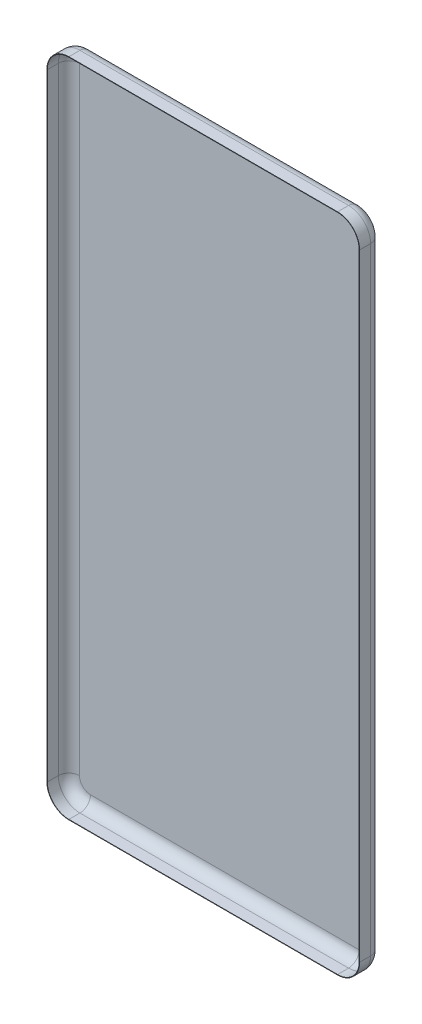
ISO-10303-21;
HEADER;
FILE_DESCRIPTION(('STEP AP214'),'2;1');
FILE_NAME('part.step','',(''),(''),'','','');
FILE_SCHEMA(('AUTOMOTIVE_DESIGN { 1 0 10303 214 1 1 1 1 }'));
ENDSEC;
DATA;
#1=APPLICATION_CONTEXT('core data for automotive mechanical design processes');
#2=APPLICATION_PROTOCOL_DEFINITION('international standard','automotive_design',2000,#1);
#3=PRODUCT_CONTEXT('',#1,'mechanical');
#4=PRODUCT('Part','Part','',(#3));
#5=PRODUCT_RELATED_PRODUCT_CATEGORY('part','',(#4));
#6=PRODUCT_DEFINITION_FORMATION('','',#4);
#7=PRODUCT_DEFINITION_CONTEXT('part definition',#1,'design');
#8=PRODUCT_DEFINITION('design','',#6,#7);
#9=PRODUCT_DEFINITION_SHAPE('','',#8);
#10=(LENGTH_UNIT() NAMED_UNIT(*) SI_UNIT(.MILLI.,.METRE.));
#11=(NAMED_UNIT(*) PLANE_ANGLE_UNIT() SI_UNIT($,.RADIAN.));
#12=(NAMED_UNIT(*) SI_UNIT($,.STERADIAN.) SOLID_ANGLE_UNIT());
#13=UNCERTAINTY_MEASURE_WITH_UNIT(LENGTH_MEASURE(1.E-05),#10,'distance_accuracy_value','');
#14=(GEOMETRIC_REPRESENTATION_CONTEXT(3) GLOBAL_UNCERTAINTY_ASSIGNED_CONTEXT((#13)) GLOBAL_UNIT_ASSIGNED_CONTEXT((#10,
#11,#12)) REPRESENTATION_CONTEXT('',''));
#15=CARTESIAN_POINT('',(0.,0.,0.));
#16=DIRECTION('',(0.,0.,1.));
#17=DIRECTION('',(1.,0.,0.));
#18=AXIS2_PLACEMENT_3D('',#15,#16,#17);
#19=CARTESIAN_POINT('',(-1300.,-2899.,200.));
#20=DIRECTION('',(0.,0.,-1.));
#21=DIRECTION('',(-1.,0.,0.));
#22=AXIS2_PLACEMENT_3D('',#19,#20,#21);
#23=CYLINDRICAL_SURFACE('',#22,100.);
#24=DIRECTION('',(0.,0.,-1.));
#25=VECTOR('',#24,1.);
#26=CARTESIAN_POINT('',(-1300.,-2999.,200.));
#27=LINE('',#26,#25);
#28=CARTESIAN_POINT('',(-1300.,-2999.,99.9999999999997));
#29=VERTEX_POINT('',#28);
#30=CARTESIAN_POINT('',(-1300.,-2999.,50.));
#31=VERTEX_POINT('',#30);
#32=EDGE_CURVE('E408',#29,#31,#27,.T.);
#33=ORIENTED_EDGE('',*,*,#32,.F.);
#34=CARTESIAN_POINT('',(-1300.,-2899.,99.9999999999997));
#35=DIRECTION('',(0.,0.,-1.));
#36=DIRECTION('',(0.,1.,0.));
#37=AXIS2_PLACEMENT_3D('',#34,#35,#36);
#38=CIRCLE('',#37,100.);
#39=CARTESIAN_POINT('',(-1400.,-2899.,99.9999999999997));
#40=VERTEX_POINT('',#39);
#41=EDGE_CURVE('E382',#29,#40,#38,.T.);
#42=ORIENTED_EDGE('',*,*,#41,.T.);
#43=DIRECTION('',(0.,0.,-1.));
#44=VECTOR('',#43,1.);
#45=CARTESIAN_POINT('',(-1400.,-2899.,200.));
#46=LINE('',#45,#44);
#47=CARTESIAN_POINT('',(-1400.,-2899.,50.));
#48=VERTEX_POINT('',#47);
#49=EDGE_CURVE('E387',#40,#48,#46,.T.);
#50=ORIENTED_EDGE('',*,*,#49,.T.);
#51=CARTESIAN_POINT('',(-1300.,-2899.,50.));
#52=DIRECTION('',(0.,0.,1.));
#53=DIRECTION('',(1.,0.,0.));
#54=AXIS2_PLACEMENT_3D('',#51,#52,#53);
#55=CIRCLE('',#54,100.);
#56=EDGE_CURVE('E411',#48,#31,#55,.T.);
#57=ORIENTED_EDGE('',*,*,#56,.T.);
#58=EDGE_LOOP('',(#33,#42,#50,#57));
#59=FACE_BOUND('',#58,.T.);
#60=ADVANCED_FACE('F39',(#59),#23,.T.);
#61=CARTESIAN_POINT('',(-1300.,-2999.,200.));
#62=DIRECTION('',(0.,1.,0.));
#63=DIRECTION('',(0.,0.,1.));
#64=AXIS2_PLACEMENT_3D('',#61,#62,#63);
#65=PLANE('',#64);
#66=DIRECTION('',(0.,0.,-1.));
#67=VECTOR('',#66,1.);
#68=CARTESIAN_POINT('',(-81.0000000000002,-2999.,200.));
#69=LINE('',#68,#67);
#70=CARTESIAN_POINT('',(-81.0000000000002,-2999.,99.9999999999997));
#71=VERTEX_POINT('',#70);
#72=CARTESIAN_POINT('',(-81.0000000000002,-2999.,50.));
#73=VERTEX_POINT('',#72);
#74=EDGE_CURVE('E405',#71,#73,#69,.T.);
#75=ORIENTED_EDGE('',*,*,#74,.F.);
#76=DIRECTION('',(-1.,0.,0.));
#77=VECTOR('',#76,1.);
#78=CARTESIAN_POINT('',(-1300.,-2999.,99.9999999999997));
#79=LINE('',#78,#77);
#80=EDGE_CURVE('E378',#71,#29,#79,.T.);
#81=ORIENTED_EDGE('',*,*,#80,.T.);
#82=ORIENTED_EDGE('',*,*,#32,.T.);
#83=DIRECTION('',(1.,0.,0.));
#84=VECTOR('',#83,1.);
#85=CARTESIAN_POINT('',(-1300.,-2999.,50.));
#86=LINE('',#85,#84);
#87=EDGE_CURVE('E440',#31,#73,#86,.T.);
#88=ORIENTED_EDGE('',*,*,#87,.T.);
#89=EDGE_LOOP('',(#75,#81,#82,#88));
#90=FACE_BOUND('',#89,.T.);
#91=ADVANCED_FACE('F552',(#90),#65,.F.);
#92=CARTESIAN_POINT('',(-80.9999999999994,-2899.,200.));
#93=DIRECTION('',(0.,0.,-1.));
#94=DIRECTION('',(-1.,0.,0.));
#95=AXIS2_PLACEMENT_3D('',#92,#93,#94);
#96=CYLINDRICAL_SURFACE('',#95,100.);
#97=DIRECTION('',(0.,0.,-1.));
#98=VECTOR('',#97,1.);
#99=CARTESIAN_POINT('',(19.0000000000006,-2899.,200.));
#100=LINE('',#99,#98);
#101=CARTESIAN_POINT('',(19.0000000000006,-2899.,99.9999999999997));
#102=VERTEX_POINT('',#101);
#103=CARTESIAN_POINT('',(19.0000000000006,-2899.,50.));
#104=VERTEX_POINT('',#103);
#105=EDGE_CURVE('E402',#102,#104,#100,.T.);
#106=ORIENTED_EDGE('',*,*,#105,.F.);
#107=CARTESIAN_POINT('',(-80.9999999999994,-2899.,99.9999999999997));
#108=DIRECTION('',(0.,0.,-1.));
#109=DIRECTION('',(0.,1.,0.));
#110=AXIS2_PLACEMENT_3D('',#107,#108,#109);
#111=CIRCLE('',#110,100.);
#112=EDGE_CURVE('E374',#102,#71,#111,.T.);
#113=ORIENTED_EDGE('',*,*,#112,.T.);
#114=ORIENTED_EDGE('',*,*,#74,.T.);
#115=CARTESIAN_POINT('',(-80.9999999999994,-2899.,50.));
#116=DIRECTION('',(0.,0.,1.));
#117=DIRECTION('',(1.,0.,0.));
#118=AXIS2_PLACEMENT_3D('',#115,#116,#117);
#119=CIRCLE('',#118,100.);
#120=EDGE_CURVE('E444',#73,#104,#119,.T.);
#121=ORIENTED_EDGE('',*,*,#120,.T.);
#122=EDGE_LOOP('',(#106,#113,#114,#121));
#123=FACE_BOUND('',#122,.T.);
#124=ADVANCED_FACE('F554',(#123),#96,.T.);
#125=CARTESIAN_POINT('',(19.0000000000001,-100.000000000001,200.));
#126=DIRECTION('',(-1.,0.,0.));
#127=DIRECTION('',(0.,-1.,0.));
#128=AXIS2_PLACEMENT_3D('',#125,#126,#127);
#129=PLANE('',#128);
#130=DIRECTION('',(0.,0.,-1.));
#131=VECTOR('',#130,1.);
#132=CARTESIAN_POINT('',(19.0000000000001,-100.000000000001,200.));
#133=LINE('',#132,#131);
#134=CARTESIAN_POINT('',(19.0000000000001,-100.,100.));
#135=VERTEX_POINT('',#134);
#136=CARTESIAN_POINT('',(19.0000000000001,-100.000000000001,50.));
#137=VERTEX_POINT('',#136);
#138=EDGE_CURVE('E399',#135,#137,#133,.T.);
#139=ORIENTED_EDGE('',*,*,#138,.F.);
#140=DIRECTION('',(0.,1.,0.));
#141=VECTOR('',#140,1.);
#142=CARTESIAN_POINT('',(19.0000000000001,0.,100.));
#143=LINE('',#142,#141);
#144=EDGE_CURVE('E286',#102,#135,#143,.T.);
#145=ORIENTED_EDGE('',*,*,#144,.F.);
#146=ORIENTED_EDGE('',*,*,#105,.T.);
#147=DIRECTION('',(0.,1.,0.));
#148=VECTOR('',#147,1.);
#149=CARTESIAN_POINT('',(19.0000000000001,-100.000000000001,50.));
#150=LINE('',#149,#148);
#151=EDGE_CURVE('E448',#104,#137,#150,.T.);
#152=ORIENTED_EDGE('',*,*,#151,.T.);
#153=EDGE_LOOP('',(#139,#145,#146,#152));
#154=FACE_BOUND('',#153,.T.);
#155=ADVANCED_FACE('F531',(#154),#129,.F.);
#156=CARTESIAN_POINT('',(-80.9999999999999,-100.,200.));
#157=DIRECTION('',(0.,0.,-1.));
#158=DIRECTION('',(-1.,0.,0.));
#159=AXIS2_PLACEMENT_3D('',#156,#157,#158);
#160=CYLINDRICAL_SURFACE('',#159,100.);
#161=DIRECTION('',(0.,0.,-1.));
#162=VECTOR('',#161,1.);
#163=CARTESIAN_POINT('',(-81.0000000000006,0.,200.));
#164=LINE('',#163,#162);
#165=CARTESIAN_POINT('',(-81.0000000000004,0.,100.));
#166=VERTEX_POINT('',#165);
#167=CARTESIAN_POINT('',(-81.0000000000006,0.,50.));
#168=VERTEX_POINT('',#167);
#169=EDGE_CURVE('E396',#166,#168,#164,.T.);
#170=ORIENTED_EDGE('',*,*,#169,.F.);
#171=CARTESIAN_POINT('',(-80.9999999999999,-100.,100.));
#172=DIRECTION('',(0.,0.,-1.));
#173=DIRECTION('',(0.,1.,0.));
#174=AXIS2_PLACEMENT_3D('',#171,#172,#173);
#175=CIRCLE('',#174,100.);
#176=EDGE_CURVE('E370',#166,#135,#175,.T.);
#177=ORIENTED_EDGE('',*,*,#176,.T.);
#178=ORIENTED_EDGE('',*,*,#138,.T.);
#179=CARTESIAN_POINT('',(-80.9999999999999,-100.,50.));
#180=DIRECTION('',(0.,0.,1.));
#181=DIRECTION('',(1.,0.,0.));
#182=AXIS2_PLACEMENT_3D('',#179,#180,#181);
#183=CIRCLE('',#182,100.);
#184=EDGE_CURVE('E452',#137,#168,#183,.T.);
#185=ORIENTED_EDGE('',*,*,#184,.T.);
#186=EDGE_LOOP('',(#170,#177,#178,#185));
#187=FACE_BOUND('',#186,.T.);
#188=ADVANCED_FACE('F527',(#187),#160,.T.);
#189=CARTESIAN_POINT('',(-1300.,0.,200.));
#190=DIRECTION('',(0.,-1.,0.));
#191=DIRECTION('',(0.,0.,-1.));
#192=AXIS2_PLACEMENT_3D('',#189,#190,#191);
#193=PLANE('',#192);
#194=DIRECTION('',(0.,0.,-1.));
#195=VECTOR('',#194,1.);
#196=CARTESIAN_POINT('',(-1300.,0.,200.));
#197=LINE('',#196,#195);
#198=CARTESIAN_POINT('',(-1300.,-1.81318578110673E-13,100.));
#199=VERTEX_POINT('',#198);
#200=CARTESIAN_POINT('',(-1300.,0.,50.));
#201=VERTEX_POINT('',#200);
#202=EDGE_CURVE('E393',#199,#201,#197,.T.);
#203=ORIENTED_EDGE('',*,*,#202,.F.);
#204=DIRECTION('',(1.,0.,0.));
#205=VECTOR('',#204,1.);
#206=CARTESIAN_POINT('',(-1400.,-1.96192948751418E-13,100.));
#207=LINE('',#206,#205);
#208=EDGE_CURVE('E362',#199,#166,#207,.T.);
#209=ORIENTED_EDGE('',*,*,#208,.T.);
#210=ORIENTED_EDGE('',*,*,#169,.T.);
#211=DIRECTION('',(-1.,0.,0.));
#212=VECTOR('',#211,1.);
#213=CARTESIAN_POINT('',(-1300.,0.,50.));
#214=LINE('',#213,#212);
#215=EDGE_CURVE('E456',#168,#201,#214,.T.);
#216=ORIENTED_EDGE('',*,*,#215,.T.);
#217=EDGE_LOOP('',(#203,#209,#210,#216));
#218=FACE_BOUND('',#217,.T.);
#219=ADVANCED_FACE('F524',(#218),#193,.F.);
#220=CARTESIAN_POINT('',(-1300.,-100.,200.));
#221=DIRECTION('',(0.,0.,-1.));
#222=DIRECTION('',(-1.,0.,0.));
#223=AXIS2_PLACEMENT_3D('',#220,#221,#222);
#224=CYLINDRICAL_SURFACE('',#223,100.);
#225=DIRECTION('',(0.,0.,-1.));
#226=VECTOR('',#225,1.);
#227=CARTESIAN_POINT('',(-1400.,-100.000000000001,200.));
#228=LINE('',#227,#226);
#229=CARTESIAN_POINT('',(-1400.,-100.000000000001,99.9999999999998));
#230=VERTEX_POINT('',#229);
#231=CARTESIAN_POINT('',(-1400.,-100.000000000001,50.));
#232=VERTEX_POINT('',#231);
#233=EDGE_CURVE('E390',#230,#232,#228,.T.);
#234=ORIENTED_EDGE('',*,*,#233,.F.);
#235=CARTESIAN_POINT('',(-1300.,-100.,100.));
#236=DIRECTION('',(0.,0.,-1.));
#237=DIRECTION('',(0.,1.,0.));
#238=AXIS2_PLACEMENT_3D('',#235,#236,#237);
#239=CIRCLE('',#238,100.);
#240=EDGE_CURVE('E65',#230,#199,#239,.T.);
#241=ORIENTED_EDGE('',*,*,#240,.T.);
#242=ORIENTED_EDGE('',*,*,#202,.T.);
#243=CARTESIAN_POINT('',(-1300.,-100.,50.));
#244=DIRECTION('',(0.,0.,1.));
#245=DIRECTION('',(1.,0.,0.));
#246=AXIS2_PLACEMENT_3D('',#243,#244,#245);
#247=CIRCLE('',#246,100.);
#248=EDGE_CURVE('E49',#201,#232,#247,.T.);
#249=ORIENTED_EDGE('',*,*,#248,.T.);
#250=EDGE_LOOP('',(#234,#241,#242,#249));
#251=FACE_BOUND('',#250,.T.);
#252=ADVANCED_FACE('F521',(#251),#224,.T.);
#253=CARTESIAN_POINT('',(-1400.,-100.000000000001,200.));
#254=DIRECTION('',(1.,0.,0.));
#255=DIRECTION('',(0.,1.,0.));
#256=AXIS2_PLACEMENT_3D('',#253,#254,#255);
#257=PLANE('',#256);
#258=ORIENTED_EDGE('',*,*,#49,.F.);
#259=DIRECTION('',(0.,1.,0.));
#260=VECTOR('',#259,1.);
#261=CARTESIAN_POINT('',(-1400.,-1.96192948751418E-13,100.));
#262=LINE('',#261,#260);
#263=EDGE_CURVE('E359',#40,#230,#262,.T.);
#264=ORIENTED_EDGE('',*,*,#263,.T.);
#265=ORIENTED_EDGE('',*,*,#233,.T.);
#266=DIRECTION('',(0.,-1.,0.));
#267=VECTOR('',#266,1.);
#268=CARTESIAN_POINT('',(-1400.,-100.000000000001,50.));
#269=LINE('',#268,#267);
#270=EDGE_CURVE('E11',#232,#48,#269,.T.);
#271=ORIENTED_EDGE('',*,*,#270,.T.);
#272=EDGE_LOOP('',(#258,#264,#265,#271));
#273=FACE_BOUND('',#272,.T.);
#274=ADVANCED_FACE('F518',(#273),#257,.F.);
#275=CARTESIAN_POINT('',(-1300.,-2899.,0.));
#276=DIRECTION('',(0.,0.,1.));
#277=DIRECTION('',(1.,0.,0.));
#278=AXIS2_PLACEMENT_3D('',#275,#276,#277);
#279=PLANE('',#278);
#280=DIRECTION('',(1.,0.,0.));
#281=VECTOR('',#280,1.);
#282=CARTESIAN_POINT('',(-1300.,-2949.,0.));
#283=LINE('',#282,#281);
#284=CARTESIAN_POINT('',(-81.0000000000002,-2949.,0.));
#285=VERTEX_POINT('',#284);
#286=CARTESIAN_POINT('',(-1300.,-2949.,0.));
#287=VERTEX_POINT('',#286);
#288=EDGE_CURVE('E433',#285,#287,#283,.F.);
#289=ORIENTED_EDGE('',*,*,#288,.T.);
#290=CARTESIAN_POINT('',(-1300.,-2899.,0.));
#291=DIRECTION('',(0.,0.,1.));
#292=DIRECTION('',(1.,0.,0.));
#293=AXIS2_PLACEMENT_3D('',#290,#291,#292);
#294=CIRCLE('',#293,50.0000000000001);
#295=CARTESIAN_POINT('',(-1350.,-2899.,0.));
#296=VERTEX_POINT('',#295);
#297=EDGE_CURVE('E436',#287,#296,#294,.F.);
#298=ORIENTED_EDGE('',*,*,#297,.T.);
#299=DIRECTION('',(0.,-1.,0.));
#300=VECTOR('',#299,1.);
#301=CARTESIAN_POINT('',(-1350.,-2899.,0.));
#302=LINE('',#301,#300);
#303=CARTESIAN_POINT('',(-1350.,-100.,0.));
#304=VERTEX_POINT('',#303);
#305=EDGE_CURVE('E415',#296,#304,#302,.F.);
#306=ORIENTED_EDGE('',*,*,#305,.T.);
#307=CARTESIAN_POINT('',(-1300.,-100.,0.));
#308=DIRECTION('',(0.,0.,1.));
#309=DIRECTION('',(1.,0.,0.));
#310=AXIS2_PLACEMENT_3D('',#307,#308,#309);
#311=CIRCLE('',#310,50.);
#312=CARTESIAN_POINT('',(-1300.,-50.,0.));
#313=VERTEX_POINT('',#312);
#314=EDGE_CURVE('E418',#304,#313,#311,.F.);
#315=ORIENTED_EDGE('',*,*,#314,.T.);
#316=DIRECTION('',(-1.,0.,0.));
#317=VECTOR('',#316,1.);
#318=CARTESIAN_POINT('',(-1300.,-49.9999999999998,0.));
#319=LINE('',#318,#317);
#320=CARTESIAN_POINT('',(-81.0000000000002,-50.,0.));
#321=VERTEX_POINT('',#320);
#322=EDGE_CURVE('E421',#313,#321,#319,.F.);
#323=ORIENTED_EDGE('',*,*,#322,.T.);
#324=CARTESIAN_POINT('',(-80.9999999999999,-100.,0.));
#325=DIRECTION('',(0.,0.,1.));
#326=DIRECTION('',(1.,0.,0.));
#327=AXIS2_PLACEMENT_3D('',#324,#325,#326);
#328=CIRCLE('',#327,50.);
#329=CARTESIAN_POINT('',(-30.9999999999999,-100.000000000001,0.));
#330=VERTEX_POINT('',#329);
#331=EDGE_CURVE('E424',#321,#330,#328,.F.);
#332=ORIENTED_EDGE('',*,*,#331,.T.);
#333=DIRECTION('',(0.,1.,0.));
#334=VECTOR('',#333,1.);
#335=CARTESIAN_POINT('',(-30.9999999999995,-2899.,0.));
#336=LINE('',#335,#334);
#337=CARTESIAN_POINT('',(-30.9999999999994,-2899.,0.));
#338=VERTEX_POINT('',#337);
#339=EDGE_CURVE('E427',#330,#338,#336,.F.);
#340=ORIENTED_EDGE('',*,*,#339,.T.);
#341=CARTESIAN_POINT('',(-80.9999999999994,-2899.,0.));
#342=DIRECTION('',(0.,0.,1.));
#343=DIRECTION('',(1.,0.,0.));
#344=AXIS2_PLACEMENT_3D('',#341,#342,#343);
#345=CIRCLE('',#344,50.);
#346=EDGE_CURVE('E430',#338,#285,#345,.F.);
#347=ORIENTED_EDGE('',*,*,#346,.T.);
#348=EDGE_LOOP('',(#289,#298,#306,#315,#323,#332,#340,#347));
#349=FACE_BOUND('',#348,.T.);
#350=ADVANCED_FACE('F503',(#349),#279,.F.);
#351=CARTESIAN_POINT('',(-80.9999999999999,-100.,50.));
#352=DIRECTION('',(0.,0.,1.));
#353=DIRECTION('',(1.,0.,0.));
#354=AXIS2_PLACEMENT_3D('',#351,#352,#353);
#355=DEGENERATE_TOROIDAL_SURFACE('',#354,50.,50.,.T.);
#356=CARTESIAN_POINT('',(-30.9999999999999,-100.000000000001,50.));
#357=DIRECTION('',(0.,-1.,0.));
#358=DIRECTION('',(1.,0.,0.));
#359=AXIS2_PLACEMENT_3D('',#356,#357,#358);
#360=CIRCLE('',#359,50.);
#361=EDGE_CURVE('E484',#330,#137,#360,.T.);
#362=ORIENTED_EDGE('',*,*,#361,.F.);
#363=ORIENTED_EDGE('',*,*,#331,.F.);
#364=CARTESIAN_POINT('',(-81.0000000000002,-50.,50.));
#365=DIRECTION('',(-1.,0.,0.));
#366=DIRECTION('',(0.,-1.,0.));
#367=AXIS2_PLACEMENT_3D('',#364,#365,#366);
#368=CIRCLE('',#367,50.);
#369=EDGE_CURVE('E43',#168,#321,#368,.T.);
#370=ORIENTED_EDGE('',*,*,#369,.F.);
#371=ORIENTED_EDGE('',*,*,#184,.F.);
#372=EDGE_LOOP('',(#362,#363,#370,#371));
#373=FACE_BOUND('',#372,.T.);
#374=ADVANCED_FACE('F41',(#373),#355,.T.);
#375=CARTESIAN_POINT('',(-1300.,-50.,50.));
#376=DIRECTION('',(-1.,0.,0.));
#377=DIRECTION('',(0.,0.,1.));
#378=AXIS2_PLACEMENT_3D('',#375,#376,#377);
#379=CYLINDRICAL_SURFACE('',#378,50.);
#380=ORIENTED_EDGE('',*,*,#369,.T.);
#381=ORIENTED_EDGE('',*,*,#322,.F.);
#382=CARTESIAN_POINT('',(-1300.,-50.,50.));
#383=DIRECTION('',(-1.,0.,0.));
#384=DIRECTION('',(0.,0.,1.));
#385=AXIS2_PLACEMENT_3D('',#382,#383,#384);
#386=CIRCLE('',#385,50.);
#387=EDGE_CURVE('E481',#201,#313,#386,.T.);
#388=ORIENTED_EDGE('',*,*,#387,.F.);
#389=ORIENTED_EDGE('',*,*,#215,.F.);
#390=EDGE_LOOP('',(#380,#381,#388,#389));
#391=FACE_BOUND('',#390,.T.);
#392=ADVANCED_FACE('F497',(#391),#379,.T.);
#393=CARTESIAN_POINT('',(-30.9999999999999,-100.000000000001,50.));
#394=DIRECTION('',(0.,1.,0.));
#395=DIRECTION('',(-1.,0.,0.));
#396=AXIS2_PLACEMENT_3D('',#393,#394,#395);
#397=CYLINDRICAL_SURFACE('',#396,50.);
#398=ORIENTED_EDGE('',*,*,#361,.T.);
#399=ORIENTED_EDGE('',*,*,#151,.F.);
#400=CARTESIAN_POINT('',(-30.9999999999994,-2899.,50.));
#401=DIRECTION('',(0.,-1.,0.));
#402=DIRECTION('',(0.,0.,-1.));
#403=AXIS2_PLACEMENT_3D('',#400,#401,#402);
#404=CIRCLE('',#403,50.);
#405=EDGE_CURVE('E477',#338,#104,#404,.T.);
#406=ORIENTED_EDGE('',*,*,#405,.F.);
#407=ORIENTED_EDGE('',*,*,#339,.F.);
#408=EDGE_LOOP('',(#398,#399,#406,#407));
#409=FACE_BOUND('',#408,.T.);
#410=ADVANCED_FACE('F533',(#409),#397,.T.);
#411=CARTESIAN_POINT('',(-1300.,-100.,50.));
#412=DIRECTION('',(0.,0.,1.));
#413=DIRECTION('',(1.,0.,0.));
#414=AXIS2_PLACEMENT_3D('',#411,#412,#413);
#415=TOROIDAL_SURFACE('',#414,50.,50.);
#416=ORIENTED_EDGE('',*,*,#387,.T.);
#417=ORIENTED_EDGE('',*,*,#314,.F.);
#418=CARTESIAN_POINT('',(-1350.,-100.,50.));
#419=DIRECTION('',(0.,-1.,0.));
#420=DIRECTION('',(1.,0.,0.));
#421=AXIS2_PLACEMENT_3D('',#418,#419,#420);
#422=CIRCLE('',#421,50.);
#423=EDGE_CURVE('E473',#232,#304,#422,.T.);
#424=ORIENTED_EDGE('',*,*,#423,.F.);
#425=ORIENTED_EDGE('',*,*,#248,.F.);
#426=EDGE_LOOP('',(#416,#417,#424,#425));
#427=FACE_BOUND('',#426,.T.);
#428=ADVANCED_FACE('F509',(#427),#415,.T.);
#429=CARTESIAN_POINT('',(-80.9999999999994,-2899.,50.));
#430=DIRECTION('',(0.,0.,1.));
#431=DIRECTION('',(1.,0.,0.));
#432=AXIS2_PLACEMENT_3D('',#429,#430,#431);
#433=TOROIDAL_SURFACE('',#432,50.,50.);
#434=ORIENTED_EDGE('',*,*,#405,.T.);
#435=ORIENTED_EDGE('',*,*,#120,.F.);
#436=CARTESIAN_POINT('',(-81.0000000000002,-2949.,50.));
#437=DIRECTION('',(-1.,0.,0.));
#438=DIRECTION('',(0.,0.,1.));
#439=AXIS2_PLACEMENT_3D('',#436,#437,#438);
#440=CIRCLE('',#439,50.);
#441=EDGE_CURVE('E469',#285,#73,#440,.T.);
#442=ORIENTED_EDGE('',*,*,#441,.F.);
#443=ORIENTED_EDGE('',*,*,#346,.F.);
#444=EDGE_LOOP('',(#434,#435,#442,#443));
#445=FACE_BOUND('',#444,.T.);
#446=ADVANCED_FACE('F537',(#445),#433,.T.);
#447=CARTESIAN_POINT('',(-1350.,-100.000000000001,50.));
#448=DIRECTION('',(0.,-1.,0.));
#449=DIRECTION('',(1.,0.,0.));
#450=AXIS2_PLACEMENT_3D('',#447,#448,#449);
#451=CYLINDRICAL_SURFACE('',#450,50.);
#452=ORIENTED_EDGE('',*,*,#423,.T.);
#453=ORIENTED_EDGE('',*,*,#305,.F.);
#454=CARTESIAN_POINT('',(-1350.,-2899.,50.));
#455=DIRECTION('',(0.,-1.,0.));
#456=DIRECTION('',(0.,0.,-1.));
#457=AXIS2_PLACEMENT_3D('',#454,#455,#456);
#458=CIRCLE('',#457,50.);
#459=EDGE_CURVE('E466',#48,#296,#458,.T.);
#460=ORIENTED_EDGE('',*,*,#459,.F.);
#461=ORIENTED_EDGE('',*,*,#270,.F.);
#462=EDGE_LOOP('',(#452,#453,#460,#461));
#463=FACE_BOUND('',#462,.T.);
#464=ADVANCED_FACE('F513',(#463),#451,.T.);
#465=CARTESIAN_POINT('',(-1300.,-2949.,50.));
#466=DIRECTION('',(1.,0.,0.));
#467=DIRECTION('',(0.,0.,-1.));
#468=AXIS2_PLACEMENT_3D('',#465,#466,#467);
#469=CYLINDRICAL_SURFACE('',#468,50.);
#470=ORIENTED_EDGE('',*,*,#441,.T.);
#471=ORIENTED_EDGE('',*,*,#87,.F.);
#472=CARTESIAN_POINT('',(-1300.,-2949.,50.));
#473=DIRECTION('',(-1.,0.,0.));
#474=DIRECTION('',(0.,-1.,0.));
#475=AXIS2_PLACEMENT_3D('',#472,#473,#474);
#476=CIRCLE('',#475,50.);
#477=EDGE_CURVE('E386',#287,#31,#476,.T.);
#478=ORIENTED_EDGE('',*,*,#477,.F.);
#479=ORIENTED_EDGE('',*,*,#288,.F.);
#480=EDGE_LOOP('',(#470,#471,#478,#479));
#481=FACE_BOUND('',#480,.T.);
#482=ADVANCED_FACE('F546',(#481),#469,.T.);
#483=CARTESIAN_POINT('',(-1300.,-2899.,50.));
#484=DIRECTION('',(0.,0.,1.));
#485=DIRECTION('',(1.,0.,0.));
#486=AXIS2_PLACEMENT_3D('',#483,#484,#485);
#487=TOROIDAL_SURFACE('',#486,50.0000000000001,50.);
#488=ORIENTED_EDGE('',*,*,#459,.T.);
#489=ORIENTED_EDGE('',*,*,#297,.F.);
#490=ORIENTED_EDGE('',*,*,#477,.T.);
#491=ORIENTED_EDGE('',*,*,#56,.F.);
#492=EDGE_LOOP('',(#488,#489,#490,#491));
#493=FACE_BOUND('',#492,.T.);
#494=ADVANCED_FACE('F544',(#493),#487,.T.);
#495=CARTESIAN_POINT('',(-1400.,-1.96192948751418E-13,100.));
#496=DIRECTION('',(0.,0.,-1.));
#497=DIRECTION('',(0.,1.,0.));
#498=AXIS2_PLACEMENT_3D('',#495,#496,#497);
#499=PLANE('',#498);
#500=CARTESIAN_POINT('',(-80.9999999999994,-2899.,99.9999999999997));
#501=DIRECTION('',(0.,0.,-1.));
#502=DIRECTION('',(0.,1.,0.));
#503=AXIS2_PLACEMENT_3D('',#500,#501,#502);
#504=CIRCLE('',#503,98.);
#505=CARTESIAN_POINT('',(17.0000000000006,-2899.,99.9999999999997));
#506=VERTEX_POINT('',#505);
#507=CARTESIAN_POINT('',(-81.0000000000001,-2997.,99.9999999999997));
#508=VERTEX_POINT('',#507);
#509=EDGE_CURVE('E336',#506,#508,#504,.T.);
#510=ORIENTED_EDGE('',*,*,#509,.T.);
#511=DIRECTION('',(-1.,0.,0.));
#512=VECTOR('',#511,1.);
#513=CARTESIAN_POINT('',(-1300.,-2997.,99.9999999999997));
#514=LINE('',#513,#512);
#515=CARTESIAN_POINT('',(-1300.,-2997.,99.9999999999997));
#516=VERTEX_POINT('',#515);
#517=EDGE_CURVE('E333',#508,#516,#514,.T.);
#518=ORIENTED_EDGE('',*,*,#517,.T.);
#519=CARTESIAN_POINT('',(-1300.,-2899.,99.9999999999997));
#520=DIRECTION('',(0.,0.,-1.));
#521=DIRECTION('',(0.,1.,0.));
#522=AXIS2_PLACEMENT_3D('',#519,#520,#521);
#523=CIRCLE('',#522,98.0000000000001);
#524=CARTESIAN_POINT('',(-1398.,-2899.,99.9999999999997));
#525=VERTEX_POINT('',#524);
#526=EDGE_CURVE('E207',#516,#525,#523,.T.);
#527=ORIENTED_EDGE('',*,*,#526,.T.);
#528=DIRECTION('',(0.,1.,0.));
#529=VECTOR('',#528,1.);
#530=CARTESIAN_POINT('',(-1398.,-100.000000000001,100.));
#531=LINE('',#530,#529);
#532=CARTESIAN_POINT('',(-1398.,-100.000000000001,99.9999999999998));
#533=VERTEX_POINT('',#532);
#534=EDGE_CURVE('E344',#525,#533,#531,.T.);
#535=ORIENTED_EDGE('',*,*,#534,.T.);
#536=CARTESIAN_POINT('',(-1300.,-100.,100.));
#537=DIRECTION('',(0.,0.,-1.));
#538=DIRECTION('',(0.,1.,0.));
#539=AXIS2_PLACEMENT_3D('',#536,#537,#538);
#540=CIRCLE('',#539,98.);
#541=CARTESIAN_POINT('',(-1300.,-1.99999999999996,100.));
#542=VERTEX_POINT('',#541);
#543=EDGE_CURVE('E348',#533,#542,#540,.T.);
#544=ORIENTED_EDGE('',*,*,#543,.T.);
#545=DIRECTION('',(1.,0.,0.));
#546=VECTOR('',#545,1.);
#547=CARTESIAN_POINT('',(-1300.,-2.,100.));
#548=LINE('',#547,#546);
#549=CARTESIAN_POINT('',(-81.0000000000004,-2.,100.));
#550=VERTEX_POINT('',#549);
#551=EDGE_CURVE('E349',#542,#550,#548,.T.);
#552=ORIENTED_EDGE('',*,*,#551,.T.);
#553=CARTESIAN_POINT('',(-80.9999999999999,-100.,100.));
#554=DIRECTION('',(0.,0.,-1.));
#555=DIRECTION('',(0.,1.,0.));
#556=AXIS2_PLACEMENT_3D('',#553,#554,#555);
#557=CIRCLE('',#556,98.);
#558=CARTESIAN_POINT('',(17.0000000000001,-100.,100.));
#559=VERTEX_POINT('',#558);
#560=EDGE_CURVE('E340',#550,#559,#557,.T.);
#561=ORIENTED_EDGE('',*,*,#560,.T.);
#562=DIRECTION('',(0.,1.,0.));
#563=VECTOR('',#562,1.);
#564=CARTESIAN_POINT('',(17.0000000000001,0.,100.));
#565=LINE('',#564,#563);
#566=EDGE_CURVE('E341',#506,#559,#565,.T.);
#567=ORIENTED_EDGE('',*,*,#566,.F.);
#568=EDGE_LOOP('',(#510,#518,#527,#535,#544,#552,#561,#567));
#569=FACE_BOUND('',#568,.T.);
#570=ORIENTED_EDGE('',*,*,#80,.F.);
#571=ORIENTED_EDGE('',*,*,#112,.F.);
#572=ORIENTED_EDGE('',*,*,#144,.T.);
#573=ORIENTED_EDGE('',*,*,#176,.F.);
#574=ORIENTED_EDGE('',*,*,#208,.F.);
#575=ORIENTED_EDGE('',*,*,#240,.F.);
#576=ORIENTED_EDGE('',*,*,#263,.F.);
#577=ORIENTED_EDGE('',*,*,#41,.F.);
#578=EDGE_LOOP('',(#570,#571,#572,#573,#574,#575,#576,#577));
#579=FACE_BOUND('',#578,.T.);
#580=ADVANCED_FACE('F551',(#569,#579),#499,.F.);
#581=CARTESIAN_POINT('',(-1300.,-2899.,200.));
#582=DIRECTION('',(0.,0.,-1.));
#583=DIRECTION('',(-1.,0.,0.));
#584=AXIS2_PLACEMENT_3D('',#581,#582,#583);
#585=CYLINDRICAL_SURFACE('',#584,98.0000000000001);
#586=DIRECTION('',(0.,0.,1.));
#587=VECTOR('',#586,1.);
#588=CARTESIAN_POINT('',(-1300.,-2997.,200.));
#589=LINE('',#588,#587);
#590=CARTESIAN_POINT('',(-1300.,-2997.,50.));
#591=VERTEX_POINT('',#590);
#592=EDGE_CURVE('E201',#516,#591,#589,.F.);
#593=ORIENTED_EDGE('',*,*,#592,.T.);
#594=CARTESIAN_POINT('',(-1300.,-2899.,50.));
#595=DIRECTION('',(0.,0.,-1.));
#596=DIRECTION('',(-1.,0.,0.));
#597=AXIS2_PLACEMENT_3D('',#594,#595,#596);
#598=CIRCLE('',#597,98.0000000000001);
#599=CARTESIAN_POINT('',(-1398.,-2899.,50.));
#600=VERTEX_POINT('',#599);
#601=EDGE_CURVE('E205',#600,#591,#598,.F.);
#602=ORIENTED_EDGE('',*,*,#601,.F.);
#603=DIRECTION('',(0.,0.,-1.));
#604=VECTOR('',#603,1.);
#605=CARTESIAN_POINT('',(-1398.,-2899.,200.));
#606=LINE('',#605,#604);
#607=EDGE_CURVE('E57',#525,#600,#606,.T.);
#608=ORIENTED_EDGE('',*,*,#607,.F.);
#609=ORIENTED_EDGE('',*,*,#526,.F.);
#610=EDGE_LOOP('',(#593,#602,#608,#609));
#611=FACE_BOUND('',#610,.T.);
#612=ADVANCED_FACE('F203',(#611),#585,.F.);
#613=CARTESIAN_POINT('',(-1300.,-2997.,200.));
#614=DIRECTION('',(0.,1.,0.));
#615=DIRECTION('',(0.,0.,1.));
#616=AXIS2_PLACEMENT_3D('',#613,#614,#615);
#617=PLANE('',#616);
#618=DIRECTION('',(0.,0.,-1.));
#619=VECTOR('',#618,1.);
#620=CARTESIAN_POINT('',(-81.0000000000001,-2997.,200.));
#621=LINE('',#620,#619);
#622=CARTESIAN_POINT('',(-81.0000000000001,-2997.,50.));
#623=VERTEX_POINT('',#622);
#624=EDGE_CURVE('E212',#508,#623,#621,.T.);
#625=ORIENTED_EDGE('',*,*,#624,.T.);
#626=DIRECTION('',(1.,0.,0.));
#627=VECTOR('',#626,1.);
#628=CARTESIAN_POINT('',(-1300.,-2997.,50.));
#629=LINE('',#628,#627);
#630=EDGE_CURVE('E220',#591,#623,#629,.T.);
#631=ORIENTED_EDGE('',*,*,#630,.F.);
#632=ORIENTED_EDGE('',*,*,#592,.F.);
#633=ORIENTED_EDGE('',*,*,#517,.F.);
#634=EDGE_LOOP('',(#625,#631,#632,#633));
#635=FACE_BOUND('',#634,.T.);
#636=ADVANCED_FACE('F230',(#635),#617,.T.);
#637=CARTESIAN_POINT('',(-80.9999999999994,-2899.,200.));
#638=DIRECTION('',(0.,0.,-1.));
#639=DIRECTION('',(-1.,0.,0.));
#640=AXIS2_PLACEMENT_3D('',#637,#638,#639);
#641=CYLINDRICAL_SURFACE('',#640,98.);
#642=DIRECTION('',(0.,0.,1.));
#643=VECTOR('',#642,1.);
#644=CARTESIAN_POINT('',(17.0000000000006,-2899.,200.));
#645=LINE('',#644,#643);
#646=CARTESIAN_POINT('',(17.0000000000006,-2899.,50.));
#647=VERTEX_POINT('',#646);
#648=EDGE_CURVE('E247',#506,#647,#645,.F.);
#649=ORIENTED_EDGE('',*,*,#648,.T.);
#650=CARTESIAN_POINT('',(-80.9999999999994,-2899.,50.));
#651=DIRECTION('',(0.,0.,-1.));
#652=DIRECTION('',(-1.,0.,0.));
#653=AXIS2_PLACEMENT_3D('',#650,#651,#652);
#654=CIRCLE('',#653,98.);
#655=EDGE_CURVE('E233',#623,#647,#654,.F.);
#656=ORIENTED_EDGE('',*,*,#655,.F.);
#657=ORIENTED_EDGE('',*,*,#624,.F.);
#658=ORIENTED_EDGE('',*,*,#509,.F.);
#659=EDGE_LOOP('',(#649,#656,#657,#658));
#660=FACE_BOUND('',#659,.T.);
#661=ADVANCED_FACE('F642',(#660),#641,.F.);
#662=CARTESIAN_POINT('',(17.0000000000001,-100.000000000001,200.));
#663=DIRECTION('',(-1.,0.,0.));
#664=DIRECTION('',(0.,-1.,0.));
#665=AXIS2_PLACEMENT_3D('',#662,#663,#664);
#666=PLANE('',#665);
#667=DIRECTION('',(0.,0.,-1.));
#668=VECTOR('',#667,1.);
#669=CARTESIAN_POINT('',(17.0000000000001,-100.000000000001,200.));
#670=LINE('',#669,#668);
#671=CARTESIAN_POINT('',(17.0000000000001,-100.000000000001,50.));
#672=VERTEX_POINT('',#671);
#673=EDGE_CURVE('E251',#559,#672,#670,.T.);
#674=ORIENTED_EDGE('',*,*,#673,.T.);
#675=DIRECTION('',(0.,-1.,0.));
#676=VECTOR('',#675,1.);
#677=CARTESIAN_POINT('',(17.0000000000001,-100.000000000001,50.));
#678=LINE('',#677,#676);
#679=EDGE_CURVE('E255',#647,#672,#678,.F.);
#680=ORIENTED_EDGE('',*,*,#679,.F.);
#681=ORIENTED_EDGE('',*,*,#648,.F.);
#682=ORIENTED_EDGE('',*,*,#566,.T.);
#683=EDGE_LOOP('',(#674,#680,#681,#682));
#684=FACE_BOUND('',#683,.T.);
#685=ADVANCED_FACE('F651',(#684),#666,.T.);
#686=CARTESIAN_POINT('',(-80.9999999999999,-100.,200.));
#687=DIRECTION('',(0.,0.,-1.));
#688=DIRECTION('',(-1.,0.,0.));
#689=AXIS2_PLACEMENT_3D('',#686,#687,#688);
#690=CYLINDRICAL_SURFACE('',#689,98.);
#691=DIRECTION('',(0.,0.,-1.));
#692=VECTOR('',#691,1.);
#693=CARTESIAN_POINT('',(-81.0000000000004,-2.,200.));
#694=LINE('',#693,#692);
#695=CARTESIAN_POINT('',(-81.0000000000006,-2.,50.));
#696=VERTEX_POINT('',#695);
#697=EDGE_CURVE('E258',#550,#696,#694,.T.);
#698=ORIENTED_EDGE('',*,*,#697,.T.);
#699=CARTESIAN_POINT('',(-80.9999999999999,-100.,50.));
#700=DIRECTION('',(0.,0.,-1.));
#701=DIRECTION('',(-1.,0.,0.));
#702=AXIS2_PLACEMENT_3D('',#699,#700,#701);
#703=CIRCLE('',#702,98.);
#704=EDGE_CURVE('E262',#672,#696,#703,.F.);
#705=ORIENTED_EDGE('',*,*,#704,.F.);
#706=ORIENTED_EDGE('',*,*,#673,.F.);
#707=ORIENTED_EDGE('',*,*,#560,.F.);
#708=EDGE_LOOP('',(#698,#705,#706,#707));
#709=FACE_BOUND('',#708,.T.);
#710=ADVANCED_FACE('F661',(#709),#690,.F.);
#711=CARTESIAN_POINT('',(-1300.,-2.,200.));
#712=DIRECTION('',(0.,-1.,0.));
#713=DIRECTION('',(0.,0.,-1.));
#714=AXIS2_PLACEMENT_3D('',#711,#712,#713);
#715=PLANE('',#714);
#716=DIRECTION('',(0.,0.,-1.));
#717=VECTOR('',#716,1.);
#718=CARTESIAN_POINT('',(-1300.,-1.99999999999996,200.));
#719=LINE('',#718,#717);
#720=CARTESIAN_POINT('',(-1300.,-1.99999999999996,50.));
#721=VERTEX_POINT('',#720);
#722=EDGE_CURVE('E265',#542,#721,#719,.T.);
#723=ORIENTED_EDGE('',*,*,#722,.T.);
#724=DIRECTION('',(1.,0.,0.));
#725=VECTOR('',#724,1.);
#726=CARTESIAN_POINT('',(-1300.,-2.,50.));
#727=LINE('',#726,#725);
#728=EDGE_CURVE('E269',#696,#721,#727,.F.);
#729=ORIENTED_EDGE('',*,*,#728,.F.);
#730=ORIENTED_EDGE('',*,*,#697,.F.);
#731=ORIENTED_EDGE('',*,*,#551,.F.);
#732=EDGE_LOOP('',(#723,#729,#730,#731));
#733=FACE_BOUND('',#732,.T.);
#734=ADVANCED_FACE('F671',(#733),#715,.T.);
#735=CARTESIAN_POINT('',(-1300.,-100.,200.));
#736=DIRECTION('',(0.,0.,-1.));
#737=DIRECTION('',(-1.,0.,0.));
#738=AXIS2_PLACEMENT_3D('',#735,#736,#737);
#739=CYLINDRICAL_SURFACE('',#738,98.);
#740=DIRECTION('',(0.,0.,1.));
#741=VECTOR('',#740,1.);
#742=CARTESIAN_POINT('',(-1398.,-100.000000000001,200.));
#743=LINE('',#742,#741);
#744=CARTESIAN_POINT('',(-1398.,-100.000000000001,50.));
#745=VERTEX_POINT('',#744);
#746=EDGE_CURVE('E272',#533,#745,#743,.F.);
#747=ORIENTED_EDGE('',*,*,#746,.T.);
#748=CARTESIAN_POINT('',(-1300.,-100.,50.));
#749=DIRECTION('',(0.,0.,-1.));
#750=DIRECTION('',(-1.,0.,0.));
#751=AXIS2_PLACEMENT_3D('',#748,#749,#750);
#752=CIRCLE('',#751,98.);
#753=EDGE_CURVE('E276',#721,#745,#752,.F.);
#754=ORIENTED_EDGE('',*,*,#753,.F.);
#755=ORIENTED_EDGE('',*,*,#722,.F.);
#756=ORIENTED_EDGE('',*,*,#543,.F.);
#757=EDGE_LOOP('',(#747,#754,#755,#756));
#758=FACE_BOUND('',#757,.T.);
#759=ADVANCED_FACE('F681',(#758),#739,.F.);
#760=CARTESIAN_POINT('',(-1398.,-100.000000000001,200.));
#761=DIRECTION('',(1.,0.,0.));
#762=DIRECTION('',(0.,1.,0.));
#763=AXIS2_PLACEMENT_3D('',#760,#761,#762);
#764=PLANE('',#763);
#765=ORIENTED_EDGE('',*,*,#607,.T.);
#766=DIRECTION('',(0.,1.,0.));
#767=VECTOR('',#766,1.);
#768=CARTESIAN_POINT('',(-1398.,-100.000000000001,50.));
#769=LINE('',#768,#767);
#770=EDGE_CURVE('E282',#745,#600,#769,.F.);
#771=ORIENTED_EDGE('',*,*,#770,.F.);
#772=ORIENTED_EDGE('',*,*,#746,.F.);
#773=ORIENTED_EDGE('',*,*,#534,.F.);
#774=EDGE_LOOP('',(#765,#771,#772,#773));
#775=FACE_BOUND('',#774,.T.);
#776=ADVANCED_FACE('F691',(#775),#764,.T.);
#777=CARTESIAN_POINT('',(-1300.,-2899.,2.));
#778=DIRECTION('',(0.,0.,1.));
#779=DIRECTION('',(1.,0.,0.));
#780=AXIS2_PLACEMENT_3D('',#777,#778,#779);
#781=PLANE('',#780);
#782=DIRECTION('',(1.,0.,0.));
#783=VECTOR('',#782,1.);
#784=CARTESIAN_POINT('',(-1300.,-2949.,2.));
#785=LINE('',#784,#783);
#786=CARTESIAN_POINT('',(-81.0000000000002,-2949.,2.));
#787=VERTEX_POINT('',#786);
#788=CARTESIAN_POINT('',(-1300.,-2949.,2.));
#789=VERTEX_POINT('',#788);
#790=EDGE_CURVE('E223',#787,#789,#785,.F.);
#791=ORIENTED_EDGE('',*,*,#790,.F.);
#792=CARTESIAN_POINT('',(-80.9999999999994,-2899.,1.99999999999999));
#793=DIRECTION('',(0.,0.,1.));
#794=DIRECTION('',(1.,0.,0.));
#795=AXIS2_PLACEMENT_3D('',#792,#793,#794);
#796=CIRCLE('',#795,50.0000000000001);
#797=CARTESIAN_POINT('',(-30.9999999999995,-2899.,2.));
#798=VERTEX_POINT('',#797);
#799=EDGE_CURVE('E303',#798,#787,#796,.F.);
#800=ORIENTED_EDGE('',*,*,#799,.F.);
#801=DIRECTION('',(0.,1.,0.));
#802=VECTOR('',#801,1.);
#803=CARTESIAN_POINT('',(-30.9999999999999,-2899.,2.));
#804=LINE('',#803,#802);
#805=CARTESIAN_POINT('',(-30.9999999999999,-100.000000000001,2.));
#806=VERTEX_POINT('',#805);
#807=EDGE_CURVE('E311',#806,#798,#804,.F.);
#808=ORIENTED_EDGE('',*,*,#807,.F.);
#809=CARTESIAN_POINT('',(-80.9999999999999,-100.,1.99999999999999));
#810=DIRECTION('',(0.,0.,1.));
#811=DIRECTION('',(1.,0.,0.));
#812=AXIS2_PLACEMENT_3D('',#809,#810,#811);
#813=CIRCLE('',#812,50.);
#814=CARTESIAN_POINT('',(-81.0000000000002,-49.9999999999998,2.));
#815=VERTEX_POINT('',#814);
#816=EDGE_CURVE('E308',#815,#806,#813,.F.);
#817=ORIENTED_EDGE('',*,*,#816,.F.);
#818=DIRECTION('',(1.,0.,0.));
#819=VECTOR('',#818,1.);
#820=CARTESIAN_POINT('',(-1300.,-49.9999999999998,2.));
#821=LINE('',#820,#819);
#822=CARTESIAN_POINT('',(-1300.,-49.9999999999998,2.));
#823=VERTEX_POINT('',#822);
#824=EDGE_CURVE('E295',#823,#815,#821,.T.);
#825=ORIENTED_EDGE('',*,*,#824,.F.);
#826=CARTESIAN_POINT('',(-1300.,-100.,1.99999999999999));
#827=DIRECTION('',(0.,0.,1.));
#828=DIRECTION('',(1.,0.,0.));
#829=AXIS2_PLACEMENT_3D('',#826,#827,#828);
#830=CIRCLE('',#829,50.);
#831=CARTESIAN_POINT('',(-1350.,-100.000000000001,2.));
#832=VERTEX_POINT('',#831);
#833=EDGE_CURVE('E242',#832,#823,#830,.F.);
#834=ORIENTED_EDGE('',*,*,#833,.F.);
#835=DIRECTION('',(0.,1.,0.));
#836=VECTOR('',#835,1.);
#837=CARTESIAN_POINT('',(-1350.,-2899.,2.));
#838=LINE('',#837,#836);
#839=CARTESIAN_POINT('',(-1350.,-2899.,1.99999999999999));
#840=VERTEX_POINT('',#839);
#841=EDGE_CURVE('E239',#840,#832,#838,.T.);
#842=ORIENTED_EDGE('',*,*,#841,.F.);
#843=CARTESIAN_POINT('',(-1300.,-2899.,1.99999999999999));
#844=DIRECTION('',(0.,0.,1.));
#845=DIRECTION('',(1.,0.,0.));
#846=AXIS2_PLACEMENT_3D('',#843,#844,#845);
#847=CIRCLE('',#846,50.0000000000001);
#848=EDGE_CURVE('E234',#789,#840,#847,.F.);
#849=ORIENTED_EDGE('',*,*,#848,.F.);
#850=EDGE_LOOP('',(#791,#800,#808,#817,#825,#834,#842,#849));
#851=FACE_BOUND('',#850,.T.);
#852=ADVANCED_FACE('F701',(#851),#781,.T.);
#853=CARTESIAN_POINT('',(-80.9999999999999,-100.,50.));
#854=DIRECTION('',(0.,0.,1.));
#855=DIRECTION('',(1.,0.,0.));
#856=AXIS2_PLACEMENT_3D('',#853,#854,#855);
#857=TOROIDAL_SURFACE('',#856,50.,48.);
#858=CARTESIAN_POINT('',(-30.9999999999999,-100.000000000001,50.));
#859=DIRECTION('',(0.,1.,0.));
#860=DIRECTION('',(-1.,0.,0.));
#861=AXIS2_PLACEMENT_3D('',#858,#859,#860);
#862=CIRCLE('',#861,48.);
#863=EDGE_CURVE('E291',#806,#672,#862,.F.);
#864=ORIENTED_EDGE('',*,*,#863,.T.);
#865=ORIENTED_EDGE('',*,*,#704,.T.);
#866=CARTESIAN_POINT('',(-81.0000000000006,-50.,50.));
#867=DIRECTION('',(-1.,0.,0.));
#868=DIRECTION('',(0.,0.,1.));
#869=AXIS2_PLACEMENT_3D('',#866,#867,#868);
#870=CIRCLE('',#869,48.);
#871=EDGE_CURVE('E319',#696,#815,#870,.T.);
#872=ORIENTED_EDGE('',*,*,#871,.T.);
#873=ORIENTED_EDGE('',*,*,#816,.T.);
#874=EDGE_LOOP('',(#864,#865,#872,#873));
#875=FACE_BOUND('',#874,.T.);
#876=ADVANCED_FACE('F711',(#875),#857,.F.);
#877=CARTESIAN_POINT('',(-1300.,-50.,50.));
#878=DIRECTION('',(-1.,0.,0.));
#879=DIRECTION('',(0.,0.,1.));
#880=AXIS2_PLACEMENT_3D('',#877,#878,#879);
#881=CYLINDRICAL_SURFACE('',#880,48.);
#882=ORIENTED_EDGE('',*,*,#871,.F.);
#883=ORIENTED_EDGE('',*,*,#728,.T.);
#884=CARTESIAN_POINT('',(-1300.,-50.,50.));
#885=DIRECTION('',(1.,0.,0.));
#886=DIRECTION('',(0.,1.,0.));
#887=AXIS2_PLACEMENT_3D('',#884,#885,#886);
#888=CIRCLE('',#887,48.);
#889=EDGE_CURVE('E287',#721,#823,#888,.F.);
#890=ORIENTED_EDGE('',*,*,#889,.T.);
#891=ORIENTED_EDGE('',*,*,#824,.T.);
#892=EDGE_LOOP('',(#882,#883,#890,#891));
#893=FACE_BOUND('',#892,.T.);
#894=ADVANCED_FACE('F721',(#893),#881,.F.);
#895=CARTESIAN_POINT('',(-30.9999999999999,-100.000000000001,50.));
#896=DIRECTION('',(0.,1.,0.));
#897=DIRECTION('',(-1.,0.,0.));
#898=AXIS2_PLACEMENT_3D('',#895,#896,#897);
#899=CYLINDRICAL_SURFACE('',#898,48.);
#900=ORIENTED_EDGE('',*,*,#863,.F.);
#901=ORIENTED_EDGE('',*,*,#807,.T.);
#902=CARTESIAN_POINT('',(-30.9999999999994,-2899.,50.));
#903=DIRECTION('',(0.,-1.,0.));
#904=DIRECTION('',(1.,0.,0.));
#905=AXIS2_PLACEMENT_3D('',#902,#903,#904);
#906=CIRCLE('',#905,48.);
#907=EDGE_CURVE('E292',#798,#647,#906,.T.);
#908=ORIENTED_EDGE('',*,*,#907,.T.);
#909=ORIENTED_EDGE('',*,*,#679,.T.);
#910=EDGE_LOOP('',(#900,#901,#908,#909));
#911=FACE_BOUND('',#910,.T.);
#912=ADVANCED_FACE('F731',(#911),#899,.F.);
#913=CARTESIAN_POINT('',(-1300.,-100.,50.));
#914=DIRECTION('',(0.,0.,1.));
#915=DIRECTION('',(1.,0.,0.));
#916=AXIS2_PLACEMENT_3D('',#913,#914,#915);
#917=TOROIDAL_SURFACE('',#916,50.,48.);
#918=ORIENTED_EDGE('',*,*,#889,.F.);
#919=ORIENTED_EDGE('',*,*,#753,.T.);
#920=CARTESIAN_POINT('',(-1350.,-100.000000000001,50.));
#921=DIRECTION('',(0.,-1.,0.));
#922=DIRECTION('',(1.,0.,0.));
#923=AXIS2_PLACEMENT_3D('',#920,#921,#922);
#924=CIRCLE('',#923,48.);
#925=EDGE_CURVE('E296',#745,#832,#924,.T.);
#926=ORIENTED_EDGE('',*,*,#925,.T.);
#927=ORIENTED_EDGE('',*,*,#833,.T.);
#928=EDGE_LOOP('',(#918,#919,#926,#927));
#929=FACE_BOUND('',#928,.T.);
#930=ADVANCED_FACE('F741',(#929),#917,.F.);
#931=CARTESIAN_POINT('',(-80.9999999999994,-2899.,50.));
#932=DIRECTION('',(0.,0.,1.));
#933=DIRECTION('',(1.,0.,0.));
#934=AXIS2_PLACEMENT_3D('',#931,#932,#933);
#935=TOROIDAL_SURFACE('',#934,50.,48.);
#936=ORIENTED_EDGE('',*,*,#907,.F.);
#937=ORIENTED_EDGE('',*,*,#799,.T.);
#938=CARTESIAN_POINT('',(-81.0000000000002,-2949.,50.));
#939=DIRECTION('',(1.,0.,0.));
#940=DIRECTION('',(0.,0.,-1.));
#941=AXIS2_PLACEMENT_3D('',#938,#939,#940);
#942=CIRCLE('',#941,48.);
#943=EDGE_CURVE('E300',#787,#623,#942,.F.);
#944=ORIENTED_EDGE('',*,*,#943,.T.);
#945=ORIENTED_EDGE('',*,*,#655,.T.);
#946=EDGE_LOOP('',(#936,#937,#944,#945));
#947=FACE_BOUND('',#946,.T.);
#948=ADVANCED_FACE('F751',(#947),#935,.F.);
#949=CARTESIAN_POINT('',(-1350.,-100.000000000001,50.));
#950=DIRECTION('',(0.,-1.,0.));
#951=DIRECTION('',(1.,0.,0.));
#952=AXIS2_PLACEMENT_3D('',#949,#950,#951);
#953=CYLINDRICAL_SURFACE('',#952,48.);
#954=ORIENTED_EDGE('',*,*,#925,.F.);
#955=ORIENTED_EDGE('',*,*,#770,.T.);
#956=CARTESIAN_POINT('',(-1350.,-2899.,50.));
#957=DIRECTION('',(0.,1.,0.));
#958=DIRECTION('',(-1.,0.,0.));
#959=AXIS2_PLACEMENT_3D('',#956,#957,#958);
#960=CIRCLE('',#959,48.);
#961=EDGE_CURVE('E228',#600,#840,#960,.F.);
#962=ORIENTED_EDGE('',*,*,#961,.T.);
#963=ORIENTED_EDGE('',*,*,#841,.T.);
#964=EDGE_LOOP('',(#954,#955,#962,#963));
#965=FACE_BOUND('',#964,.T.);
#966=ADVANCED_FACE('F761',(#965),#953,.F.);
#967=CARTESIAN_POINT('',(-1300.,-2949.,50.));
#968=DIRECTION('',(1.,0.,0.));
#969=DIRECTION('',(0.,0.,-1.));
#970=AXIS2_PLACEMENT_3D('',#967,#968,#969);
#971=CYLINDRICAL_SURFACE('',#970,48.);
#972=ORIENTED_EDGE('',*,*,#943,.F.);
#973=ORIENTED_EDGE('',*,*,#790,.T.);
#974=CARTESIAN_POINT('',(-1300.,-2949.,50.));
#975=DIRECTION('',(-1.,0.,0.));
#976=DIRECTION('',(0.,-1.,0.));
#977=AXIS2_PLACEMENT_3D('',#974,#975,#976);
#978=CIRCLE('',#977,48.);
#979=EDGE_CURVE('E217',#789,#591,#978,.T.);
#980=ORIENTED_EDGE('',*,*,#979,.T.);
#981=ORIENTED_EDGE('',*,*,#630,.T.);
#982=EDGE_LOOP('',(#972,#973,#980,#981));
#983=FACE_BOUND('',#982,.T.);
#984=ADVANCED_FACE('F219',(#983),#971,.F.);
#985=CARTESIAN_POINT('',(-1300.,-2899.,50.));
#986=DIRECTION('',(0.,0.,1.));
#987=DIRECTION('',(1.,0.,0.));
#988=AXIS2_PLACEMENT_3D('',#985,#986,#987);
#989=TOROIDAL_SURFACE('',#988,50.0000000000001,48.);
#990=ORIENTED_EDGE('',*,*,#961,.F.);
#991=ORIENTED_EDGE('',*,*,#601,.T.);
#992=ORIENTED_EDGE('',*,*,#979,.F.);
#993=ORIENTED_EDGE('',*,*,#848,.T.);
#994=EDGE_LOOP('',(#990,#991,#992,#993));
#995=FACE_BOUND('',#994,.T.);
#996=ADVANCED_FACE('F237',(#995),#989,.F.);
#997=CLOSED_SHELL('',(#60,#91,#124,#155,#188,#219,#252,#274,#350,#374,#392,#410,#428,#446,#464,
#482,#494,#580,#612,#636,#661,#685,#710,#734,#759,#776,#852,#876,#894,#912,#930,#948,#966,#984,#996));
#998=MANIFOLD_SOLID_BREP('B2',#997);
#999=ADVANCED_BREP_SHAPE_REPRESENTATION('',(#18,#998),#14);
#1000=SHAPE_DEFINITION_REPRESENTATION(#9,#999);
ENDSEC;
END-ISO-10303-21;
